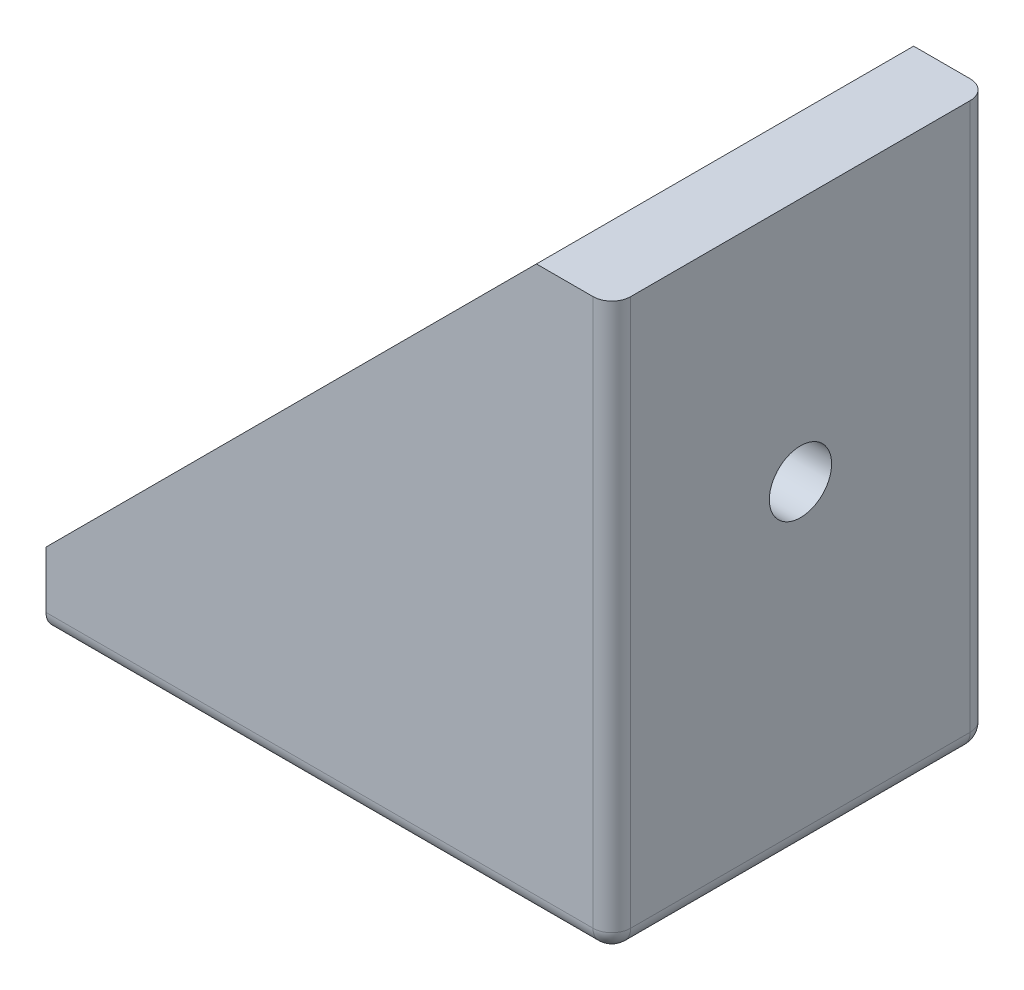
ISO-10303-21;
HEADER;
FILE_DESCRIPTION(('STEP AP214'),'2;1');
FILE_NAME('part.step','',(''),(''),'','','');
FILE_SCHEMA(('AUTOMOTIVE_DESIGN { 1 0 10303 214 1 1 1 1 }'));
ENDSEC;
DATA;
#1=APPLICATION_CONTEXT('core data for automotive mechanical design processes');
#2=APPLICATION_PROTOCOL_DEFINITION('international standard','automotive_design',2000,#1);
#3=PRODUCT_CONTEXT('',#1,'mechanical');
#4=PRODUCT('Part','Part','',(#3));
#5=PRODUCT_RELATED_PRODUCT_CATEGORY('part','',(#4));
#6=PRODUCT_DEFINITION_FORMATION('','',#4);
#7=PRODUCT_DEFINITION_CONTEXT('part definition',#1,'design');
#8=PRODUCT_DEFINITION('design','',#6,#7);
#9=PRODUCT_DEFINITION_SHAPE('','',#8);
#10=(LENGTH_UNIT() NAMED_UNIT(*) SI_UNIT(.MILLI.,.METRE.));
#11=(NAMED_UNIT(*) PLANE_ANGLE_UNIT() SI_UNIT($,.RADIAN.));
#12=(NAMED_UNIT(*) SI_UNIT($,.STERADIAN.) SOLID_ANGLE_UNIT());
#13=UNCERTAINTY_MEASURE_WITH_UNIT(LENGTH_MEASURE(1.E-05),#10,'distance_accuracy_value','');
#14=(GEOMETRIC_REPRESENTATION_CONTEXT(3) GLOBAL_UNCERTAINTY_ASSIGNED_CONTEXT((#13)) GLOBAL_UNIT_ASSIGNED_CONTEXT((#10,
#11,#12)) REPRESENTATION_CONTEXT('',''));
#15=CARTESIAN_POINT('',(0.,0.,0.));
#16=DIRECTION('',(0.,0.,1.));
#17=DIRECTION('',(1.,0.,0.));
#18=AXIS2_PLACEMENT_3D('',#15,#16,#17);
#19=CARTESIAN_POINT('',(-4.,30.,10.));
#20=DIRECTION('',(0.707106781186548,-0.707106781186547,0.));
#21=DIRECTION('',(0.707106781186547,0.707106781186548,0.));
#22=AXIS2_PLACEMENT_3D('',#19,#20,#21);
#23=PLANE('',#22);
#24=DIRECTION('',(-0.707106781186547,-0.707106781186548,0.));
#25=VECTOR('',#24,1.);
#26=CARTESIAN_POINT('',(-4.,30.,-6.));
#27=LINE('',#26,#25);
#28=CARTESIAN_POINT('',(-5.,29.,-6.));
#29=VERTEX_POINT('',#28);
#30=CARTESIAN_POINT('',(-29.,5.,-6.));
#31=VERTEX_POINT('',#30);
#32=EDGE_CURVE('E338',#29,#31,#27,.T.);
#33=ORIENTED_EDGE('',*,*,#32,.F.);
#34=CARTESIAN_POINT('',(-5.,29.,-5.));
#35=DIRECTION('',(0.707106781186548,-0.707106781186547,0.));
#36=DIRECTION('',(-0.707106781186547,-0.707106781186548,0.));
#37=AXIS2_PLACEMENT_3D('',#34,#35,#36);
#38=ELLIPSE('',#37,1.4142135623731,1.);
#39=CARTESIAN_POINT('',(-4.,30.,-5.));
#40=VERTEX_POINT('',#39);
#41=EDGE_CURVE('E209',#29,#40,#38,.T.);
#42=ORIENTED_EDGE('',*,*,#41,.T.);
#43=DIRECTION('',(0.,0.,-1.));
#44=VECTOR('',#43,1.);
#45=CARTESIAN_POINT('',(-4.,30.,10.));
#46=LINE('',#45,#44);
#47=CARTESIAN_POINT('',(-4.,30.,-10.));
#48=VERTEX_POINT('',#47);
#49=EDGE_CURVE('E169',#40,#48,#46,.T.);
#50=ORIENTED_EDGE('',*,*,#49,.T.);
#51=DIRECTION('',(-0.707106781186547,-0.707106781186548,0.));
#52=VECTOR('',#51,1.);
#53=CARTESIAN_POINT('',(-4.,30.,-10.));
#54=LINE('',#53,#52);
#55=CARTESIAN_POINT('',(-30.,4.,-10.));
#56=VERTEX_POINT('',#55);
#57=EDGE_CURVE('E181',#48,#56,#54,.T.);
#58=ORIENTED_EDGE('',*,*,#57,.T.);
#59=DIRECTION('',(0.,0.,-1.));
#60=VECTOR('',#59,1.);
#61=CARTESIAN_POINT('',(-30.,4.,10.));
#62=LINE('',#61,#60);
#63=CARTESIAN_POINT('',(-30.,4.,-5.));
#64=VERTEX_POINT('',#63);
#65=EDGE_CURVE('E188',#64,#56,#62,.T.);
#66=ORIENTED_EDGE('',*,*,#65,.F.);
#67=CARTESIAN_POINT('',(-29.,5.,-5.));
#68=DIRECTION('',(0.707106781186548,-0.707106781186547,0.));
#69=DIRECTION('',(-0.707106781186547,-0.707106781186548,0.));
#70=AXIS2_PLACEMENT_3D('',#67,#68,#69);
#71=ELLIPSE('',#70,1.4142135623731,1.);
#72=EDGE_CURVE('E11',#64,#31,#71,.T.);
#73=ORIENTED_EDGE('',*,*,#72,.T.);
#74=EDGE_LOOP('',(#33,#42,#50,#58,#66,#73));
#75=FACE_BOUND('',#74,.T.);
#76=ADVANCED_FACE('F36',(#75),#23,.F.);
#77=CARTESIAN_POINT('',(0.,0.,10.));
#78=DIRECTION('',(-1.,0.,0.));
#79=DIRECTION('',(0.,0.,1.));
#80=AXIS2_PLACEMENT_3D('',#77,#78,#79);
#81=PLANE('',#80);
#82=CARTESIAN_POINT('',(0.,17.,0.));
#83=DIRECTION('',(-1.,0.,0.));
#84=DIRECTION('',(0.,0.,1.));
#85=AXIS2_PLACEMENT_3D('',#82,#83,#84);
#86=CIRCLE('',#85,1.65);
#87=CARTESIAN_POINT('',(0.,17.,1.65));
#88=VERTEX_POINT('',#87);
#89=EDGE_CURVE('E622',#88,#88,#86,.T.);
#90=ORIENTED_EDGE('',*,*,#89,.T.);
#91=EDGE_LOOP('',(#90));
#92=FACE_BOUND('',#91,.T.);
#93=DIRECTION('',(0.,0.,-1.));
#94=VECTOR('',#93,1.);
#95=CARTESIAN_POINT('',(0.,1.,10.));
#96=LINE('',#95,#94);
#97=CARTESIAN_POINT('',(0.,1.,9.));
#98=VERTEX_POINT('',#97);
#99=CARTESIAN_POINT('',(0.,1.,-9.));
#100=VERTEX_POINT('',#99);
#101=EDGE_CURVE('E201',#98,#100,#96,.T.);
#102=ORIENTED_EDGE('',*,*,#101,.T.);
#103=DIRECTION('',(0.,1.,0.));
#104=VECTOR('',#103,1.);
#105=CARTESIAN_POINT('',(0.,0.,-9.));
#106=LINE('',#105,#104);
#107=CARTESIAN_POINT('',(0.,30.,-9.));
#108=VERTEX_POINT('',#107);
#109=EDGE_CURVE('E252',#100,#108,#106,.T.);
#110=ORIENTED_EDGE('',*,*,#109,.T.);
#111=DIRECTION('',(0.,0.,-1.));
#112=VECTOR('',#111,1.);
#113=CARTESIAN_POINT('',(0.,30.,10.));
#114=LINE('',#113,#112);
#115=CARTESIAN_POINT('',(0.,30.,9.));
#116=VERTEX_POINT('',#115);
#117=EDGE_CURVE('E168',#116,#108,#114,.T.);
#118=ORIENTED_EDGE('',*,*,#117,.F.);
#119=DIRECTION('',(0.,1.,0.));
#120=VECTOR('',#119,1.);
#121=CARTESIAN_POINT('',(0.,1.,9.));
#122=LINE('',#121,#120);
#123=EDGE_CURVE('E250',#116,#98,#122,.F.);
#124=ORIENTED_EDGE('',*,*,#123,.T.);
#125=EDGE_LOOP('',(#102,#110,#118,#124));
#126=FACE_BOUND('',#125,.T.);
#127=ADVANCED_FACE('F309',(#92,#126),#81,.F.);
#128=CARTESIAN_POINT('',(0.,30.,10.));
#129=DIRECTION('',(0.,-1.,0.));
#130=DIRECTION('',(1.,0.,0.));
#131=AXIS2_PLACEMENT_3D('',#128,#129,#130);
#132=PLANE('',#131);
#133=ORIENTED_EDGE('',*,*,#117,.T.);
#134=CARTESIAN_POINT('',(-1.,30.,-9.));
#135=DIRECTION('',(0.,-1.,0.));
#136=DIRECTION('',(1.,0.,0.));
#137=AXIS2_PLACEMENT_3D('',#134,#135,#136);
#138=CIRCLE('',#137,1.);
#139=CARTESIAN_POINT('',(-1.,30.,-10.));
#140=VERTEX_POINT('',#139);
#141=EDGE_CURVE('E256',#108,#140,#138,.F.);
#142=ORIENTED_EDGE('',*,*,#141,.T.);
#143=DIRECTION('',(-1.,0.,0.));
#144=VECTOR('',#143,1.);
#145=CARTESIAN_POINT('',(0.,30.,-10.));
#146=LINE('',#145,#144);
#147=EDGE_CURVE('E179',#140,#48,#146,.T.);
#148=ORIENTED_EDGE('',*,*,#147,.T.);
#149=ORIENTED_EDGE('',*,*,#49,.F.);
#150=DIRECTION('',(0.,0.,-1.));
#151=VECTOR('',#150,1.);
#152=CARTESIAN_POINT('',(-4.,30.,10.));
#153=LINE('',#152,#151);
#154=CARTESIAN_POINT('',(-4.,30.,5.));
#155=VERTEX_POINT('',#154);
#156=EDGE_CURVE('E165',#155,#40,#153,.T.);
#157=ORIENTED_EDGE('',*,*,#156,.F.);
#158=CARTESIAN_POINT('',(-4.,30.,10.));
#159=VERTEX_POINT('',#158);
#160=EDGE_CURVE('E161',#159,#155,#46,.T.);
#161=ORIENTED_EDGE('',*,*,#160,.F.);
#162=DIRECTION('',(-1.,0.,0.));
#163=VECTOR('',#162,1.);
#164=CARTESIAN_POINT('',(0.,30.,10.));
#165=LINE('',#164,#163);
#166=CARTESIAN_POINT('',(-1.,30.,10.));
#167=VERTEX_POINT('',#166);
#168=EDGE_CURVE('E146',#167,#159,#165,.T.);
#169=ORIENTED_EDGE('',*,*,#168,.F.);
#170=CARTESIAN_POINT('',(-1.,30.,9.));
#171=DIRECTION('',(0.,-1.,0.));
#172=DIRECTION('',(1.,0.,0.));
#173=AXIS2_PLACEMENT_3D('',#170,#171,#172);
#174=CIRCLE('',#173,1.);
#175=EDGE_CURVE('E254',#167,#116,#174,.F.);
#176=ORIENTED_EDGE('',*,*,#175,.T.);
#177=EDGE_LOOP('',(#133,#142,#148,#149,#157,#161,#169,#176));
#178=FACE_BOUND('',#177,.T.);
#179=ADVANCED_FACE('F163',(#178),#132,.F.);
#180=ORIENTED_EDGE('',*,*,#160,.T.);
#181=CARTESIAN_POINT('',(-5.,29.,5.));
#182=DIRECTION('',(0.707106781186548,-0.707106781186547,0.));
#183=DIRECTION('',(0.707106781186547,0.707106781186548,0.));
#184=AXIS2_PLACEMENT_3D('',#181,#182,#183);
#185=ELLIPSE('',#184,1.4142135623731,1.);
#186=CARTESIAN_POINT('',(-5.,29.,6.));
#187=VERTEX_POINT('',#186);
#188=EDGE_CURVE('E207',#155,#187,#185,.T.);
#189=ORIENTED_EDGE('',*,*,#188,.T.);
#190=DIRECTION('',(-0.707106781186547,-0.707106781186548,0.));
#191=VECTOR('',#190,1.);
#192=CARTESIAN_POINT('',(-4.,30.,6.));
#193=LINE('',#192,#191);
#194=CARTESIAN_POINT('',(-29.,5.,6.));
#195=VERTEX_POINT('',#194);
#196=EDGE_CURVE('E332',#187,#195,#193,.T.);
#197=ORIENTED_EDGE('',*,*,#196,.T.);
#198=CARTESIAN_POINT('',(-29.,5.,5.));
#199=DIRECTION('',(0.707106781186548,-0.707106781186547,0.));
#200=DIRECTION('',(0.707106781186547,0.707106781186548,0.));
#201=AXIS2_PLACEMENT_3D('',#198,#199,#200);
#202=ELLIPSE('',#201,1.4142135623731,1.);
#203=CARTESIAN_POINT('',(-30.,4.,5.));
#204=VERTEX_POINT('',#203);
#205=EDGE_CURVE('E46',#195,#204,#202,.T.);
#206=ORIENTED_EDGE('',*,*,#205,.T.);
#207=CARTESIAN_POINT('',(-30.,4.,10.));
#208=VERTEX_POINT('',#207);
#209=EDGE_CURVE('E54',#208,#204,#62,.T.);
#210=ORIENTED_EDGE('',*,*,#209,.F.);
#211=DIRECTION('',(-0.707106781186547,-0.707106781186548,0.));
#212=VECTOR('',#211,1.);
#213=CARTESIAN_POINT('',(-4.,30.,10.));
#214=LINE('',#213,#212);
#215=EDGE_CURVE('E151',#159,#208,#214,.T.);
#216=ORIENTED_EDGE('',*,*,#215,.F.);
#217=EDGE_LOOP('',(#180,#189,#197,#206,#210,#216));
#218=FACE_BOUND('',#217,.T.);
#219=ADVANCED_FACE('F171',(#218),#23,.F.);
#220=CARTESIAN_POINT('',(-30.,0.,10.));
#221=DIRECTION('',(1.,0.,0.));
#222=DIRECTION('',(0.,1.,0.));
#223=AXIS2_PLACEMENT_3D('',#220,#221,#222);
#224=PLANE('',#223);
#225=DIRECTION('',(0.,-1.,0.));
#226=VECTOR('',#225,1.);
#227=CARTESIAN_POINT('',(-30.,0.,-10.));
#228=LINE('',#227,#226);
#229=CARTESIAN_POINT('',(-30.,0.999999999999996,-10.));
#230=VERTEX_POINT('',#229);
#231=EDGE_CURVE('E157',#56,#230,#228,.T.);
#232=ORIENTED_EDGE('',*,*,#231,.T.);
#233=CARTESIAN_POINT('',(-30.,0.999999999999996,-9.));
#234=DIRECTION('',(1.,0.,0.));
#235=DIRECTION('',(0.,1.,0.));
#236=AXIS2_PLACEMENT_3D('',#233,#234,#235);
#237=CIRCLE('',#236,1.);
#238=CARTESIAN_POINT('',(-30.,0.,-9.));
#239=VERTEX_POINT('',#238);
#240=EDGE_CURVE('E239',#230,#239,#237,.F.);
#241=ORIENTED_EDGE('',*,*,#240,.T.);
#242=DIRECTION('',(0.,0.,-1.));
#243=VECTOR('',#242,1.);
#244=CARTESIAN_POINT('',(-30.,0.,10.));
#245=LINE('',#244,#243);
#246=CARTESIAN_POINT('',(-30.,0.,9.));
#247=VERTEX_POINT('',#246);
#248=EDGE_CURVE('E175',#247,#239,#245,.T.);
#249=ORIENTED_EDGE('',*,*,#248,.F.);
#250=CARTESIAN_POINT('',(-30.,0.999999999999997,9.));
#251=DIRECTION('',(1.,0.,0.));
#252=DIRECTION('',(0.,1.,0.));
#253=AXIS2_PLACEMENT_3D('',#250,#251,#252);
#254=CIRCLE('',#253,1.);
#255=CARTESIAN_POINT('',(-30.,0.999999999999997,10.));
#256=VERTEX_POINT('',#255);
#257=EDGE_CURVE('E237',#247,#256,#254,.F.);
#258=ORIENTED_EDGE('',*,*,#257,.T.);
#259=DIRECTION('',(0.,-1.,0.));
#260=VECTOR('',#259,1.);
#261=CARTESIAN_POINT('',(-30.,0.,10.));
#262=LINE('',#261,#260);
#263=EDGE_CURVE('E173',#208,#256,#262,.T.);
#264=ORIENTED_EDGE('',*,*,#263,.F.);
#265=ORIENTED_EDGE('',*,*,#209,.T.);
#266=DIRECTION('',(0.,0.,-1.));
#267=VECTOR('',#266,1.);
#268=CARTESIAN_POINT('',(-30.,4.,10.));
#269=LINE('',#268,#267);
#270=EDGE_CURVE('E330',#204,#64,#269,.T.);
#271=ORIENTED_EDGE('',*,*,#270,.T.);
#272=ORIENTED_EDGE('',*,*,#65,.T.);
#273=EDGE_LOOP('',(#232,#241,#249,#258,#264,#265,#271,#272));
#274=FACE_BOUND('',#273,.T.);
#275=ADVANCED_FACE('F290',(#274),#224,.F.);
#276=CARTESIAN_POINT('',(0.,0.,10.));
#277=DIRECTION('',(0.,1.,0.));
#278=DIRECTION('',(-1.,0.,0.));
#279=AXIS2_PLACEMENT_3D('',#276,#277,#278);
#280=PLANE('',#279);
#281=CARTESIAN_POINT('',(-17.,0.,0.));
#282=DIRECTION('',(0.,1.,0.));
#283=DIRECTION('',(0.,0.,1.));
#284=AXIS2_PLACEMENT_3D('',#281,#282,#283);
#285=CIRCLE('',#284,1.65);
#286=CARTESIAN_POINT('',(-17.,0.,1.65));
#287=VERTEX_POINT('',#286);
#288=EDGE_CURVE('E336',#287,#287,#285,.T.);
#289=ORIENTED_EDGE('',*,*,#288,.T.);
#290=EDGE_LOOP('',(#289));
#291=FACE_BOUND('',#290,.T.);
#292=ORIENTED_EDGE('',*,*,#248,.T.);
#293=DIRECTION('',(1.,0.,0.));
#294=VECTOR('',#293,1.);
#295=CARTESIAN_POINT('',(0.,0.,-9.));
#296=LINE('',#295,#294);
#297=CARTESIAN_POINT('',(-1.,0.,-9.));
#298=VERTEX_POINT('',#297);
#299=EDGE_CURVE('E230',#239,#298,#296,.T.);
#300=ORIENTED_EDGE('',*,*,#299,.T.);
#301=DIRECTION('',(0.,0.,-1.));
#302=VECTOR('',#301,1.);
#303=CARTESIAN_POINT('',(-1.,0.,10.));
#304=LINE('',#303,#302);
#305=CARTESIAN_POINT('',(-1.,0.,9.));
#306=VERTEX_POINT('',#305);
#307=EDGE_CURVE('E204',#298,#306,#304,.F.);
#308=ORIENTED_EDGE('',*,*,#307,.T.);
#309=DIRECTION('',(1.,0.,0.));
#310=VECTOR('',#309,1.);
#311=CARTESIAN_POINT('',(-30.,0.,9.));
#312=LINE('',#311,#310);
#313=EDGE_CURVE('E228',#306,#247,#312,.F.);
#314=ORIENTED_EDGE('',*,*,#313,.T.);
#315=EDGE_LOOP('',(#292,#300,#308,#314));
#316=FACE_BOUND('',#315,.T.);
#317=ADVANCED_FACE('F294',(#291,#316),#280,.F.);
#318=CARTESIAN_POINT('',(0.,30.,10.));
#319=DIRECTION('',(0.,0.,1.));
#320=DIRECTION('',(1.,0.,0.));
#321=AXIS2_PLACEMENT_3D('',#318,#319,#320);
#322=PLANE('',#321);
#323=ORIENTED_EDGE('',*,*,#263,.T.);
#324=DIRECTION('',(1.,0.,0.));
#325=VECTOR('',#324,1.);
#326=CARTESIAN_POINT('',(-1.,1.,10.));
#327=LINE('',#326,#325);
#328=CARTESIAN_POINT('',(-1.,1.,10.));
#329=VERTEX_POINT('',#328);
#330=EDGE_CURVE('E246',#256,#329,#327,.T.);
#331=ORIENTED_EDGE('',*,*,#330,.T.);
#332=DIRECTION('',(0.,1.,0.));
#333=VECTOR('',#332,1.);
#334=CARTESIAN_POINT('',(-1.,30.,10.));
#335=LINE('',#334,#333);
#336=EDGE_CURVE('E154',#329,#167,#335,.T.);
#337=ORIENTED_EDGE('',*,*,#336,.T.);
#338=ORIENTED_EDGE('',*,*,#168,.T.);
#339=ORIENTED_EDGE('',*,*,#215,.T.);
#340=EDGE_LOOP('',(#323,#331,#337,#338,#339));
#341=FACE_BOUND('',#340,.T.);
#342=ADVANCED_FACE('F149',(#341),#322,.T.);
#343=CARTESIAN_POINT('',(0.,30.,-10.));
#344=DIRECTION('',(0.,0.,1.));
#345=DIRECTION('',(1.,0.,0.));
#346=AXIS2_PLACEMENT_3D('',#343,#344,#345);
#347=PLANE('',#346);
#348=DIRECTION('',(0.,1.,0.));
#349=VECTOR('',#348,1.);
#350=CARTESIAN_POINT('',(-1.,30.,-10.));
#351=LINE('',#350,#349);
#352=CARTESIAN_POINT('',(-1.,1.,-10.));
#353=VERTEX_POINT('',#352);
#354=EDGE_CURVE('E233',#140,#353,#351,.F.);
#355=ORIENTED_EDGE('',*,*,#354,.T.);
#356=DIRECTION('',(1.,0.,0.));
#357=VECTOR('',#356,1.);
#358=CARTESIAN_POINT('',(0.,1.,-10.));
#359=LINE('',#358,#357);
#360=EDGE_CURVE('E235',#353,#230,#359,.F.);
#361=ORIENTED_EDGE('',*,*,#360,.T.);
#362=ORIENTED_EDGE('',*,*,#231,.F.);
#363=ORIENTED_EDGE('',*,*,#57,.F.);
#364=ORIENTED_EDGE('',*,*,#147,.F.);
#365=EDGE_LOOP('',(#355,#361,#362,#363,#364));
#366=FACE_BOUND('',#365,.T.);
#367=ADVANCED_FACE('F319',(#366),#347,.F.);
#368=CARTESIAN_POINT('',(-4.,0.,10.));
#369=DIRECTION('',(-1.,0.,0.));
#370=DIRECTION('',(0.,0.,1.));
#371=AXIS2_PLACEMENT_3D('',#368,#369,#370);
#372=PLANE('',#371);
#373=CARTESIAN_POINT('',(-4.,17.,0.));
#374=DIRECTION('',(-1.,0.,0.));
#375=DIRECTION('',(0.,0.,1.));
#376=AXIS2_PLACEMENT_3D('',#373,#374,#375);
#377=CIRCLE('',#376,1.64999999999999);
#378=CARTESIAN_POINT('',(-4.,17.,1.64999999999999));
#379=VERTEX_POINT('',#378);
#380=EDGE_CURVE('E271',#379,#379,#377,.T.);
#381=ORIENTED_EDGE('',*,*,#380,.F.);
#382=EDGE_LOOP('',(#381));
#383=FACE_BOUND('',#382,.T.);
#384=DIRECTION('',(0.,1.,0.));
#385=VECTOR('',#384,1.);
#386=CARTESIAN_POINT('',(-4.,4.,-5.));
#387=LINE('',#386,#385);
#388=CARTESIAN_POINT('',(-4.,5.,-5.));
#389=VERTEX_POINT('',#388);
#390=EDGE_CURVE('E191',#40,#389,#387,.F.);
#391=ORIENTED_EDGE('',*,*,#390,.T.);
#392=DIRECTION('',(0.,0.,-1.));
#393=VECTOR('',#392,1.);
#394=CARTESIAN_POINT('',(-4.,5.,5.));
#395=LINE('',#394,#393);
#396=CARTESIAN_POINT('',(-4.,5.,5.));
#397=VERTEX_POINT('',#396);
#398=EDGE_CURVE('E248',#389,#397,#395,.F.);
#399=ORIENTED_EDGE('',*,*,#398,.T.);
#400=DIRECTION('',(0.,1.,0.));
#401=VECTOR('',#400,1.);
#402=CARTESIAN_POINT('',(-4.,0.,5.));
#403=LINE('',#402,#401);
#404=EDGE_CURVE('E194',#397,#155,#403,.T.);
#405=ORIENTED_EDGE('',*,*,#404,.T.);
#406=ORIENTED_EDGE('',*,*,#156,.T.);
#407=EDGE_LOOP('',(#391,#399,#405,#406));
#408=FACE_BOUND('',#407,.T.);
#409=ADVANCED_FACE('F327',(#383,#408),#372,.T.);
#410=CARTESIAN_POINT('',(0.,4.,10.));
#411=DIRECTION('',(0.,1.,0.));
#412=DIRECTION('',(-1.,0.,0.));
#413=AXIS2_PLACEMENT_3D('',#410,#411,#412);
#414=PLANE('',#413);
#415=ORIENTED_EDGE('',*,*,#270,.F.);
#416=DIRECTION('',(1.,0.,0.));
#417=VECTOR('',#416,1.);
#418=CARTESIAN_POINT('',(0.,4.,5.));
#419=LINE('',#418,#417);
#420=CARTESIAN_POINT('',(-5.,4.,5.));
#421=VERTEX_POINT('',#420);
#422=EDGE_CURVE('E217',#204,#421,#419,.T.);
#423=ORIENTED_EDGE('',*,*,#422,.T.);
#424=DIRECTION('',(0.,0.,-1.));
#425=VECTOR('',#424,1.);
#426=CARTESIAN_POINT('',(-5.,4.,-5.));
#427=LINE('',#426,#425);
#428=CARTESIAN_POINT('',(-5.,4.,-5.));
#429=VERTEX_POINT('',#428);
#430=EDGE_CURVE('E212',#421,#429,#427,.T.);
#431=ORIENTED_EDGE('',*,*,#430,.T.);
#432=DIRECTION('',(1.,0.,0.));
#433=VECTOR('',#432,1.);
#434=CARTESIAN_POINT('',(-30.,4.,-5.));
#435=LINE('',#434,#433);
#436=EDGE_CURVE('E214',#429,#64,#435,.F.);
#437=ORIENTED_EDGE('',*,*,#436,.T.);
#438=EDGE_LOOP('',(#415,#423,#431,#437));
#439=FACE_BOUND('',#438,.T.);
#440=CARTESIAN_POINT('',(-17.,4.,0.));
#441=DIRECTION('',(0.,1.,0.));
#442=DIRECTION('',(0.,0.,1.));
#443=AXIS2_PLACEMENT_3D('',#440,#441,#442);
#444=CIRCLE('',#443,1.64999999999999);
#445=CARTESIAN_POINT('',(-17.,4.,1.64999999999999));
#446=VERTEX_POINT('',#445);
#447=EDGE_CURVE('E620',#446,#446,#444,.T.);
#448=ORIENTED_EDGE('',*,*,#447,.F.);
#449=EDGE_LOOP('',(#448));
#450=FACE_BOUND('',#449,.T.);
#451=ADVANCED_FACE('F351',(#439,#450),#414,.T.);
#452=CARTESIAN_POINT('',(0.,30.,6.));
#453=DIRECTION('',(0.,0.,1.));
#454=DIRECTION('',(1.,0.,0.));
#455=AXIS2_PLACEMENT_3D('',#452,#453,#454);
#456=PLANE('',#455);
#457=DIRECTION('',(0.,1.,0.));
#458=VECTOR('',#457,1.);
#459=CARTESIAN_POINT('',(-5.,30.,6.));
#460=LINE('',#459,#458);
#461=CARTESIAN_POINT('',(-5.,5.,6.));
#462=VERTEX_POINT('',#461);
#463=EDGE_CURVE('E196',#187,#462,#460,.F.);
#464=ORIENTED_EDGE('',*,*,#463,.T.);
#465=DIRECTION('',(1.,0.,0.));
#466=VECTOR('',#465,1.);
#467=CARTESIAN_POINT('',(0.,5.,6.));
#468=LINE('',#467,#466);
#469=EDGE_CURVE('E220',#462,#195,#468,.F.);
#470=ORIENTED_EDGE('',*,*,#469,.T.);
#471=ORIENTED_EDGE('',*,*,#196,.F.);
#472=EDGE_LOOP('',(#464,#470,#471));
#473=FACE_BOUND('',#472,.T.);
#474=ADVANCED_FACE('F375',(#473),#456,.F.);
#475=CARTESIAN_POINT('',(0.,30.,-6.));
#476=DIRECTION('',(0.,0.,1.));
#477=DIRECTION('',(1.,0.,0.));
#478=AXIS2_PLACEMENT_3D('',#475,#476,#477);
#479=PLANE('',#478);
#480=ORIENTED_EDGE('',*,*,#32,.T.);
#481=DIRECTION('',(1.,0.,0.));
#482=VECTOR('',#481,1.);
#483=CARTESIAN_POINT('',(-5.,5.,-6.));
#484=LINE('',#483,#482);
#485=CARTESIAN_POINT('',(-5.,5.,-6.));
#486=VERTEX_POINT('',#485);
#487=EDGE_CURVE('E224',#31,#486,#484,.T.);
#488=ORIENTED_EDGE('',*,*,#487,.T.);
#489=DIRECTION('',(0.,1.,0.));
#490=VECTOR('',#489,1.);
#491=CARTESIAN_POINT('',(-5.,30.,-6.));
#492=LINE('',#491,#490);
#493=EDGE_CURVE('E199',#486,#29,#492,.T.);
#494=ORIENTED_EDGE('',*,*,#493,.T.);
#495=EDGE_LOOP('',(#480,#488,#494));
#496=FACE_BOUND('',#495,.T.);
#497=ADVANCED_FACE('F361',(#496),#479,.T.);
#498=CARTESIAN_POINT('',(-17.,4.,0.));
#499=DIRECTION('',(0.,1.,0.));
#500=DIRECTION('',(0.,0.,1.));
#501=AXIS2_PLACEMENT_3D('',#498,#499,#500);
#502=CYLINDRICAL_SURFACE('',#501,1.64999999999999);
#503=ORIENTED_EDGE('',*,*,#288,.F.);
#504=EDGE_LOOP('',(#503));
#505=FACE_BOUND('',#504,.T.);
#506=ORIENTED_EDGE('',*,*,#447,.T.);
#507=EDGE_LOOP('',(#506));
#508=FACE_BOUND('',#507,.T.);
#509=ADVANCED_FACE('F382',(#505,#508),#502,.F.);
#510=CARTESIAN_POINT('',(-4.,17.,0.));
#511=DIRECTION('',(-1.,0.,0.));
#512=DIRECTION('',(0.,0.,1.));
#513=AXIS2_PLACEMENT_3D('',#510,#511,#512);
#514=CYLINDRICAL_SURFACE('',#513,1.64999999999999);
#515=ORIENTED_EDGE('',*,*,#89,.F.);
#516=EDGE_LOOP('',(#515));
#517=FACE_BOUND('',#516,.T.);
#518=ORIENTED_EDGE('',*,*,#380,.T.);
#519=EDGE_LOOP('',(#518));
#520=FACE_BOUND('',#519,.T.);
#521=ADVANCED_FACE('F404',(#517,#520),#514,.F.);
#522=CARTESIAN_POINT('',(-5.,0.,5.));
#523=DIRECTION('',(0.,1.,0.));
#524=DIRECTION('',(0.,0.,1.));
#525=AXIS2_PLACEMENT_3D('',#522,#523,#524);
#526=CYLINDRICAL_SURFACE('',#525,1.);
#527=ORIENTED_EDGE('',*,*,#404,.F.);
#528=CARTESIAN_POINT('',(-5.,5.,5.));
#529=DIRECTION('',(0.,1.,0.));
#530=DIRECTION('',(0.,0.,1.));
#531=AXIS2_PLACEMENT_3D('',#528,#529,#530);
#532=CIRCLE('',#531,1.);
#533=EDGE_CURVE('E222',#397,#462,#532,.F.);
#534=ORIENTED_EDGE('',*,*,#533,.T.);
#535=ORIENTED_EDGE('',*,*,#463,.F.);
#536=ORIENTED_EDGE('',*,*,#188,.F.);
#537=EDGE_LOOP('',(#527,#534,#535,#536));
#538=FACE_BOUND('',#537,.T.);
#539=ADVANCED_FACE('F374',(#538),#526,.F.);
#540=CARTESIAN_POINT('',(-5.,30.,-5.));
#541=DIRECTION('',(0.,-1.,0.));
#542=DIRECTION('',(0.,0.,-1.));
#543=AXIS2_PLACEMENT_3D('',#540,#541,#542);
#544=CYLINDRICAL_SURFACE('',#543,1.);
#545=ORIENTED_EDGE('',*,*,#493,.F.);
#546=CARTESIAN_POINT('',(-5.,5.,-5.));
#547=DIRECTION('',(0.,-1.,0.));
#548=DIRECTION('',(0.,0.,-1.));
#549=AXIS2_PLACEMENT_3D('',#546,#547,#548);
#550=CIRCLE('',#549,1.);
#551=EDGE_CURVE('E226',#486,#389,#550,.T.);
#552=ORIENTED_EDGE('',*,*,#551,.T.);
#553=ORIENTED_EDGE('',*,*,#390,.F.);
#554=ORIENTED_EDGE('',*,*,#41,.F.);
#555=EDGE_LOOP('',(#545,#552,#553,#554));
#556=FACE_BOUND('',#555,.T.);
#557=ADVANCED_FACE('F364',(#556),#544,.F.);
#558=CARTESIAN_POINT('',(-1.,1.,10.));
#559=DIRECTION('',(0.,0.,-1.));
#560=DIRECTION('',(-1.,0.,0.));
#561=AXIS2_PLACEMENT_3D('',#558,#559,#560);
#562=CYLINDRICAL_SURFACE('',#561,1.);
#563=ORIENTED_EDGE('',*,*,#307,.F.);
#564=CARTESIAN_POINT('',(-1.,1.,-9.));
#565=DIRECTION('',(0.,0.,-1.));
#566=DIRECTION('',(-1.,0.,0.));
#567=AXIS2_PLACEMENT_3D('',#564,#565,#566);
#568=CIRCLE('',#567,1.);
#569=EDGE_CURVE('E243',#298,#100,#568,.F.);
#570=ORIENTED_EDGE('',*,*,#569,.T.);
#571=ORIENTED_EDGE('',*,*,#101,.F.);
#572=CARTESIAN_POINT('',(-1.,1.,9.));
#573=DIRECTION('',(0.,0.,-1.));
#574=DIRECTION('',(-1.,0.,0.));
#575=AXIS2_PLACEMENT_3D('',#572,#573,#574);
#576=CIRCLE('',#575,1.);
#577=EDGE_CURVE('E241',#98,#306,#576,.T.);
#578=ORIENTED_EDGE('',*,*,#577,.T.);
#579=EDGE_LOOP('',(#563,#570,#571,#578));
#580=FACE_BOUND('',#579,.T.);
#581=ADVANCED_FACE('F306',(#580),#562,.T.);
#582=CARTESIAN_POINT('',(0.,5.,-5.));
#583=DIRECTION('',(-1.,0.,0.));
#584=DIRECTION('',(0.,-1.,0.));
#585=AXIS2_PLACEMENT_3D('',#582,#583,#584);
#586=CYLINDRICAL_SURFACE('',#585,1.);
#587=CARTESIAN_POINT('',(-5.,5.,-5.));
#588=DIRECTION('',(-1.,0.,0.));
#589=DIRECTION('',(0.,0.,1.));
#590=AXIS2_PLACEMENT_3D('',#587,#588,#589);
#591=CIRCLE('',#590,1.);
#592=EDGE_CURVE('E268',#486,#429,#591,.T.);
#593=ORIENTED_EDGE('',*,*,#592,.F.);
#594=ORIENTED_EDGE('',*,*,#487,.F.);
#595=ORIENTED_EDGE('',*,*,#72,.F.);
#596=ORIENTED_EDGE('',*,*,#436,.F.);
#597=EDGE_LOOP('',(#593,#594,#595,#596));
#598=FACE_BOUND('',#597,.T.);
#599=ADVANCED_FACE('F359',(#598),#586,.F.);
#600=CARTESIAN_POINT('',(-5.,5.,-5.));
#601=DIRECTION('',(0.,0.,1.));
#602=DIRECTION('',(1.,0.,0.));
#603=AXIS2_PLACEMENT_3D('',#600,#601,#602);
#604=SPHERICAL_SURFACE('',#603,1.);
#605=ORIENTED_EDGE('',*,*,#551,.F.);
#606=ORIENTED_EDGE('',*,*,#592,.T.);
#607=CARTESIAN_POINT('',(-5.,5.,-5.));
#608=DIRECTION('',(0.,0.,-1.));
#609=DIRECTION('',(-1.,0.,0.));
#610=AXIS2_PLACEMENT_3D('',#607,#608,#609);
#611=CIRCLE('',#610,1.);
#612=EDGE_CURVE('E265',#389,#429,#611,.T.);
#613=ORIENTED_EDGE('',*,*,#612,.F.);
#614=EDGE_LOOP('',(#605,#606,#613));
#615=FACE_BOUND('',#614,.T.);
#616=ADVANCED_FACE('F367',(#615),#604,.F.);
#617=CARTESIAN_POINT('',(-5.,5.,10.));
#618=DIRECTION('',(0.,0.,1.));
#619=DIRECTION('',(1.,0.,0.));
#620=AXIS2_PLACEMENT_3D('',#617,#618,#619);
#621=CYLINDRICAL_SURFACE('',#620,1.);
#622=CARTESIAN_POINT('',(-5.,5.,5.));
#623=DIRECTION('',(0.,0.,-1.));
#624=DIRECTION('',(-1.,0.,0.));
#625=AXIS2_PLACEMENT_3D('',#622,#623,#624);
#626=CIRCLE('',#625,1.);
#627=EDGE_CURVE('E261',#397,#421,#626,.T.);
#628=ORIENTED_EDGE('',*,*,#627,.F.);
#629=ORIENTED_EDGE('',*,*,#398,.F.);
#630=ORIENTED_EDGE('',*,*,#612,.T.);
#631=ORIENTED_EDGE('',*,*,#430,.F.);
#632=EDGE_LOOP('',(#628,#629,#630,#631));
#633=FACE_BOUND('',#632,.T.);
#634=ADVANCED_FACE('F371',(#633),#621,.F.);
#635=CARTESIAN_POINT('',(-5.,5.,5.));
#636=DIRECTION('',(0.,0.,1.));
#637=DIRECTION('',(1.,0.,0.));
#638=AXIS2_PLACEMENT_3D('',#635,#636,#637);
#639=SPHERICAL_SURFACE('',#638,1.);
#640=ORIENTED_EDGE('',*,*,#533,.F.);
#641=ORIENTED_EDGE('',*,*,#627,.T.);
#642=CARTESIAN_POINT('',(-5.,5.,5.));
#643=DIRECTION('',(1.,0.,0.));
#644=DIRECTION('',(0.,0.,-1.));
#645=AXIS2_PLACEMENT_3D('',#642,#643,#644);
#646=CIRCLE('',#645,1.);
#647=EDGE_CURVE('E259',#462,#421,#646,.T.);
#648=ORIENTED_EDGE('',*,*,#647,.F.);
#649=EDGE_LOOP('',(#640,#641,#648));
#650=FACE_BOUND('',#649,.T.);
#651=ADVANCED_FACE('F411',(#650),#639,.F.);
#652=CARTESIAN_POINT('',(0.,5.,5.));
#653=DIRECTION('',(1.,0.,0.));
#654=DIRECTION('',(0.,1.,0.));
#655=AXIS2_PLACEMENT_3D('',#652,#653,#654);
#656=CYLINDRICAL_SURFACE('',#655,1.);
#657=ORIENTED_EDGE('',*,*,#205,.F.);
#658=ORIENTED_EDGE('',*,*,#469,.F.);
#659=ORIENTED_EDGE('',*,*,#647,.T.);
#660=ORIENTED_EDGE('',*,*,#422,.F.);
#661=EDGE_LOOP('',(#657,#658,#659,#660));
#662=FACE_BOUND('',#661,.T.);
#663=ADVANCED_FACE('F348',(#662),#656,.F.);
#664=CARTESIAN_POINT('',(-1.,0.,-9.));
#665=DIRECTION('',(0.,1.,0.));
#666=DIRECTION('',(0.,0.,1.));
#667=AXIS2_PLACEMENT_3D('',#664,#665,#666);
#668=CYLINDRICAL_SURFACE('',#667,1.);
#669=ORIENTED_EDGE('',*,*,#141,.F.);
#670=ORIENTED_EDGE('',*,*,#109,.F.);
#671=CARTESIAN_POINT('',(-1.,1.,-9.));
#672=DIRECTION('',(0.,-1.,0.));
#673=DIRECTION('',(0.,0.,-1.));
#674=AXIS2_PLACEMENT_3D('',#671,#672,#673);
#675=CIRCLE('',#674,1.);
#676=EDGE_CURVE('E262',#353,#100,#675,.T.);
#677=ORIENTED_EDGE('',*,*,#676,.F.);
#678=ORIENTED_EDGE('',*,*,#354,.F.);
#679=EDGE_LOOP('',(#669,#670,#677,#678));
#680=FACE_BOUND('',#679,.T.);
#681=ADVANCED_FACE('F313',(#680),#668,.T.);
#682=CARTESIAN_POINT('',(-1.,1.,-9.));
#683=DIRECTION('',(0.,0.,1.));
#684=DIRECTION('',(1.,0.,0.));
#685=AXIS2_PLACEMENT_3D('',#682,#683,#684);
#686=SPHERICAL_SURFACE('',#685,1.);
#687=ORIENTED_EDGE('',*,*,#676,.T.);
#688=ORIENTED_EDGE('',*,*,#569,.F.);
#689=CARTESIAN_POINT('',(-1.,1.,-9.));
#690=DIRECTION('',(-1.,0.,0.));
#691=DIRECTION('',(0.,-1.,0.));
#692=AXIS2_PLACEMENT_3D('',#689,#690,#691);
#693=CIRCLE('',#692,1.);
#694=EDGE_CURVE('E272',#353,#298,#693,.T.);
#695=ORIENTED_EDGE('',*,*,#694,.F.);
#696=EDGE_LOOP('',(#687,#688,#695));
#697=FACE_BOUND('',#696,.T.);
#698=ADVANCED_FACE('F302',(#697),#686,.T.);
#699=CARTESIAN_POINT('',(0.,1.,-9.));
#700=DIRECTION('',(1.,0.,0.));
#701=DIRECTION('',(0.,1.,0.));
#702=AXIS2_PLACEMENT_3D('',#699,#700,#701);
#703=CYLINDRICAL_SURFACE('',#702,1.);
#704=ORIENTED_EDGE('',*,*,#240,.F.);
#705=ORIENTED_EDGE('',*,*,#360,.F.);
#706=ORIENTED_EDGE('',*,*,#694,.T.);
#707=ORIENTED_EDGE('',*,*,#299,.F.);
#708=EDGE_LOOP('',(#704,#705,#706,#707));
#709=FACE_BOUND('',#708,.T.);
#710=ADVANCED_FACE('F297',(#709),#703,.T.);
#711=CARTESIAN_POINT('',(-1.,30.,9.));
#712=DIRECTION('',(0.,-1.,0.));
#713=DIRECTION('',(0.,0.,-1.));
#714=AXIS2_PLACEMENT_3D('',#711,#712,#713);
#715=CYLINDRICAL_SURFACE('',#714,1.);
#716=CARTESIAN_POINT('',(-1.,1.,9.));
#717=DIRECTION('',(0.,-1.,0.));
#718=DIRECTION('',(0.,0.,-1.));
#719=AXIS2_PLACEMENT_3D('',#716,#717,#718);
#720=CIRCLE('',#719,1.);
#721=EDGE_CURVE('E40',#98,#329,#720,.T.);
#722=ORIENTED_EDGE('',*,*,#721,.F.);
#723=ORIENTED_EDGE('',*,*,#123,.F.);
#724=ORIENTED_EDGE('',*,*,#175,.F.);
#725=ORIENTED_EDGE('',*,*,#336,.F.);
#726=EDGE_LOOP('',(#722,#723,#724,#725));
#727=FACE_BOUND('',#726,.T.);
#728=ADVANCED_FACE('F38',(#727),#715,.T.);
#729=CARTESIAN_POINT('',(-1.,1.,9.));
#730=DIRECTION('',(0.,0.,1.));
#731=DIRECTION('',(1.,0.,0.));
#732=AXIS2_PLACEMENT_3D('',#729,#730,#731);
#733=SPHERICAL_SURFACE('',#732,1.);
#734=ORIENTED_EDGE('',*,*,#577,.F.);
#735=ORIENTED_EDGE('',*,*,#721,.T.);
#736=CARTESIAN_POINT('',(-1.,1.,9.));
#737=DIRECTION('',(-1.,0.,0.));
#738=DIRECTION('',(0.,-1.,0.));
#739=AXIS2_PLACEMENT_3D('',#736,#737,#738);
#740=CIRCLE('',#739,1.);
#741=EDGE_CURVE('E275',#306,#329,#740,.T.);
#742=ORIENTED_EDGE('',*,*,#741,.F.);
#743=EDGE_LOOP('',(#734,#735,#742));
#744=FACE_BOUND('',#743,.T.);
#745=ADVANCED_FACE('F284',(#744),#733,.T.);
#746=CARTESIAN_POINT('',(0.,1.,9.));
#747=DIRECTION('',(-1.,0.,0.));
#748=DIRECTION('',(0.,-1.,0.));
#749=AXIS2_PLACEMENT_3D('',#746,#747,#748);
#750=CYLINDRICAL_SURFACE('',#749,1.);
#751=ORIENTED_EDGE('',*,*,#257,.F.);
#752=ORIENTED_EDGE('',*,*,#313,.F.);
#753=ORIENTED_EDGE('',*,*,#741,.T.);
#754=ORIENTED_EDGE('',*,*,#330,.F.);
#755=EDGE_LOOP('',(#751,#752,#753,#754));
#756=FACE_BOUND('',#755,.T.);
#757=ADVANCED_FACE('F288',(#756),#750,.T.);
#758=CLOSED_SHELL('',(#76,#127,#179,#219,#275,#317,#342,#367,#409,#451,#474,#497,#509,#521,#539,
#557,#581,#599,#616,#634,#651,#663,#681,#698,#710,#728,#745,#757));
#759=MANIFOLD_SOLID_BREP('B2',#758);
#760=ADVANCED_BREP_SHAPE_REPRESENTATION('',(#18,#759),#14);
#761=SHAPE_DEFINITION_REPRESENTATION(#9,#760);
ENDSEC;
END-ISO-10303-21;
